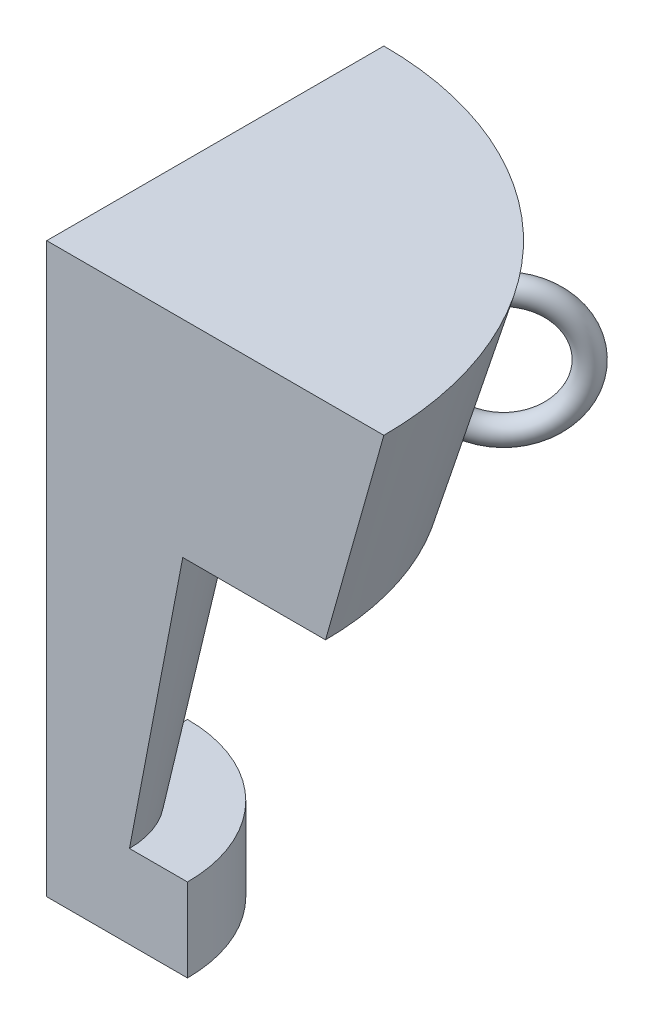
ISO-10303-21;
HEADER;
FILE_DESCRIPTION(('STEP AP214'),'2;1');
FILE_NAME('part.step','',(''),(''),'','','');
FILE_SCHEMA(('AUTOMOTIVE_DESIGN { 1 0 10303 214 1 1 1 1 }'));
ENDSEC;
DATA;
#1=APPLICATION_CONTEXT('core data for automotive mechanical design processes');
#2=APPLICATION_PROTOCOL_DEFINITION('international standard','automotive_design',2000,#1);
#3=PRODUCT_CONTEXT('',#1,'mechanical');
#4=PRODUCT('Part','Part','',(#3));
#5=PRODUCT_RELATED_PRODUCT_CATEGORY('part','',(#4));
#6=PRODUCT_DEFINITION_FORMATION('','',#4);
#7=PRODUCT_DEFINITION_CONTEXT('part definition',#1,'design');
#8=PRODUCT_DEFINITION('design','',#6,#7);
#9=PRODUCT_DEFINITION_SHAPE('','',#8);
#10=(LENGTH_UNIT() NAMED_UNIT(*) SI_UNIT(.MILLI.,.METRE.));
#11=(NAMED_UNIT(*) PLANE_ANGLE_UNIT() SI_UNIT($,.RADIAN.));
#12=(NAMED_UNIT(*) SI_UNIT($,.STERADIAN.) SOLID_ANGLE_UNIT());
#13=UNCERTAINTY_MEASURE_WITH_UNIT(LENGTH_MEASURE(1.E-05),#10,'distance_accuracy_value','');
#14=(GEOMETRIC_REPRESENTATION_CONTEXT(3) GLOBAL_UNCERTAINTY_ASSIGNED_CONTEXT((#13)) GLOBAL_UNIT_ASSIGNED_CONTEXT((#10,
#11,#12)) REPRESENTATION_CONTEXT('',''));
#15=CARTESIAN_POINT('',(0.,0.,0.));
#16=DIRECTION('',(0.,0.,1.));
#17=DIRECTION('',(1.,0.,0.));
#18=AXIS2_PLACEMENT_3D('',#15,#16,#17);
#19=CARTESIAN_POINT('',(0.,58.2177475068306,0.));
#20=DIRECTION('',(0.,1.,0.));
#21=DIRECTION('',(0.,0.,1.));
#22=AXIS2_PLACEMENT_3D('',#19,#20,#21);
#23=CONICAL_SURFACE('',#22,44.8585287538697,0.275531499985695);
#24=CARTESIAN_POINT('',(35.5940219265061,84.7891645665427,-38.4157945053826));
#25=CARTESIAN_POINT('',(35.6223648787228,84.902069427442,-38.4330502836493));
#26=CARTESIAN_POINT('',(35.6577733919979,85.0143245064468,-38.4435087468025));
#27=CARTESIAN_POINT('',(35.7417914538497,85.2343399213014,-38.4503777887173));
#28=CARTESIAN_POINT('',(35.7904158705934,85.3420950361244,-38.4467724840791));
#29=CARTESIAN_POINT('',(35.8995417309926,85.5499808432688,-38.425369114325));
#30=CARTESIAN_POINT('',(35.9600472144908,85.6501089261021,-38.4075662153717));
#31=CARTESIAN_POINT('',(36.0911823558137,85.8396841115878,-38.3579911307056));
#32=CARTESIAN_POINT('',(36.1618089725081,85.9291344078843,-38.3262231352246));
#33=CARTESIAN_POINT('',(36.3098799082835,86.0932575198573,-38.2499725804186));
#34=CARTESIAN_POINT('',(36.3871946571666,86.1681470219277,-38.2057052216436));
#35=CARTESIAN_POINT('',(36.5472756407923,86.3025581941336,-38.1052728448716));
#36=CARTESIAN_POINT('',(36.6300412549255,86.3620816099946,-38.0491091797228));
#37=CARTESIAN_POINT('',(36.7961585587554,86.4624142472336,-37.9280098034336));
#38=CARTESIAN_POINT('',(36.8794337996563,86.5036862431923,-37.8633525543629));
#39=CARTESIAN_POINT('',(37.0461746442387,86.5684746407337,-37.7259019465926));
#40=CARTESIAN_POINT('',(37.1296402184315,86.5919936272094,-37.6531097741357));
#41=CARTESIAN_POINT('',(37.2924073926879,86.6201833847608,-37.5031417191258));
#42=CARTESIAN_POINT('',(37.3717601294543,86.6252548371856,-37.4260964056653));
#43=CARTESIAN_POINT('',(37.5259022909493,86.6175022792061,-37.2684310675248));
#44=CARTESIAN_POINT('',(37.6006920169358,86.6046794515502,-37.1878112794458));
#45=CARTESIAN_POINT('',(37.7430631632084,86.5617172141566,-37.0259614259006));
#46=CARTESIAN_POINT('',(37.8106943349234,86.5317081011255,-36.9447404413342));
#47=CARTESIAN_POINT('',(37.9376004632804,86.4554129167902,-36.7834315833818));
#48=CARTESIAN_POINT('',(37.9968751817386,86.4091263816625,-36.7033437423525));
#49=CARTESIAN_POINT('',(38.106135736096,86.3011595453887,-36.5458116234191));
#50=CARTESIAN_POINT('',(38.1560264910082,86.2393351111063,-36.4684002831482));
#51=CARTESIAN_POINT('',(38.2446737574201,86.1023566650958,-36.3192092303872));
#52=CARTESIAN_POINT('',(38.2834291665744,86.0272013348637,-36.2474300759672));
#53=CARTESIAN_POINT('',(38.3497696721557,85.8638687104769,-36.1099103639366));
#54=CARTESIAN_POINT('',(38.377083827896,85.7754364779368,-36.0443420048586));
#55=CARTESIAN_POINT('',(38.418797711721,85.5893580080576,-35.9228934751294));
#56=CARTESIAN_POINT('',(38.4331957231946,85.4917105478805,-35.8670145930472));
#57=CARTESIAN_POINT('',(38.4491433327694,85.2871661227164,-35.7650666734813));
#58=CARTESIAN_POINT('',(38.4503422860982,85.1800926035725,-35.7192968855033));
#59=CARTESIAN_POINT('',(38.4391412330824,84.961974917474,-35.6407141874113));
#60=CARTESIAN_POINT('',(38.4267395634034,84.8509302664633,-35.6079028627644));
#61=CARTESIAN_POINT('',(38.388381322991,84.6255799936652,-35.5555596472536));
#62=CARTESIAN_POINT('',(38.3621520511461,84.5112541921998,-35.5363138157129));
#63=CARTESIAN_POINT('',(38.2967153265248,84.2847933676811,-35.5127288093888));
#64=CARTESIAN_POINT('',(38.2575069926458,84.1726584939096,-35.508390646862));
#65=CARTESIAN_POINT('',(38.1668229826968,83.9530804436884,-35.5147777123637));
#66=CARTESIAN_POINT('',(38.1152721810843,83.845670963491,-35.5255972383666));
#67=CARTESIAN_POINT('',(38.0013211597696,83.6394945711289,-35.5622077773303));
#68=CARTESIAN_POINT('',(37.9389212770596,83.540727390662,-35.5879983253222));
#69=CARTESIAN_POINT('',(37.8056768026994,83.3560709781234,-35.6534626714092));
#70=CARTESIAN_POINT('',(37.7349452159655,83.2700386097508,-35.6929622481263));
#71=CARTESIAN_POINT('',(37.5862706613776,83.1122412789484,-35.784819979076));
#72=CARTESIAN_POINT('',(37.5083288096778,83.0404741136527,-35.8371761451682));
#73=CARTESIAN_POINT('',(37.3496586313334,82.915513470272,-35.9515800348399));
#74=CARTESIAN_POINT('',(37.2690710119985,82.8618529906642,-36.0133125633668));
#75=CARTESIAN_POINT('',(37.1053715985544,82.7722962303663,-36.145675969043));
#76=CARTESIAN_POINT('',(37.0222603447801,82.736396175065,-36.2163049514282));
#77=CARTESIAN_POINT('',(36.8586468288307,82.6845494765044,-36.3619276240276));
#78=CARTESIAN_POINT('',(36.778146229086,82.6680007976721,-36.4367091745368));
#79=CARTESIAN_POINT('',(36.6194301682388,82.6534113748763,-36.5903820937625));
#80=CARTESIAN_POINT('',(36.5412144141309,82.6553682472419,-36.6692729318664));
#81=CARTESIAN_POINT('',(36.3907499382952,82.6775094644823,-36.8273944875767));
#82=CARTESIAN_POINT('',(36.3184191049156,82.6973648079718,-36.9065934792845));
#83=CARTESIAN_POINT('',(36.1802299530249,82.7541428993834,-37.0645088658389));
#84=CARTESIAN_POINT('',(36.1143717221061,82.7910658782396,-37.143225254141));
#85=CARTESIAN_POINT('',(35.9905225895748,82.8810297004857,-37.2985986388296));
#86=CARTESIAN_POINT('',(35.9325871012784,82.934176422143,-37.3752383941265));
#87=CARTESIAN_POINT('',(35.8266379233289,83.0547785930898,-37.5239667286859));
#88=CARTESIAN_POINT('',(35.7786249958493,83.1222351407421,-37.5960549580406));
#89=CARTESIAN_POINT('',(35.6925993846305,83.2713707342344,-37.7357976454529));
#90=CARTESIAN_POINT('',(35.6548850191172,83.3533789608014,-37.803284251261));
#91=CARTESIAN_POINT('',(35.5921098769826,83.5279137049645,-37.9300898356581));
#92=CARTESIAN_POINT('',(35.5670541034047,83.6204443636589,-37.9894055781586));
#93=CARTESIAN_POINT('',(35.5296105944291,83.8165198076264,-38.1002627857951));
#94=CARTESIAN_POINT('',(35.5176560148095,83.9203230482539,-38.1514930139458));
#95=CARTESIAN_POINT('',(35.5081701090379,84.1333486954018,-38.2425486411814));
#96=CARTESIAN_POINT('',(35.5106242987993,84.2425655505071,-38.2823854509969));
#97=CARTESIAN_POINT('',(35.526490074069,84.4251711537533,-38.3380746145571));
#98=CARTESIAN_POINT('',(35.535816999852,84.49788269378,-38.3574566011826));
#99=CARTESIAN_POINT('',(35.560460643071,84.643540755464,-38.3907627875939));
#100=CARTESIAN_POINT('',(35.5757774610894,84.7164872810468,-38.404686895723));
#101=CARTESIAN_POINT('',(35.5940219265061,84.7891645665427,-38.4157945053826));
#102=B_SPLINE_CURVE_WITH_KNOTS('',3,(#24,#25,#26,#27,#28,#29,#30,#31,#32,#33,#34,#35,#36,#37,
#38,#39,#40,#41,#42,#43,#44,#45,#46,#47,#48,#49,#50,#51,#52,#53,#54,#55,#56,#57,#58,#59,#60,#61,
#62,#63,#64,#65,#66,#67,#68,#69,#70,#71,#72,#73,#74,#75,#76,#77,#78,#79,#80,#81,#82,#83,#84,#85,
#86,#87,#88,#89,#90,#91,#92,#93,#94,#95,#96,#97,#98,#99,#100,#101),.UNSPECIFIED.,.T.,.F.,(4,2,2,
2,2,2,2,2,2,2,2,2,2,2,2,2,2,2,2,2,2,2,2,2,2,2,2,2,2,2,2,2,2,2,2,2,2,2,4),(0.,0.352769212094957,
0.70593695151238,1.05922498487448,1.41240708632363,1.75984483660488,2.10724309744979,
2.44524179016257,2.78319125972566,3.1137550857224,3.44429706365569,3.77236562041532,
4.10044352621319,4.43168497679216,4.76295920738553,5.1016868189281,5.44045944215904,
5.78821080460619,6.1360047012334,6.49092937086553,6.84587814001958,7.20304492395916,
7.5602006156327,7.91297422699695,8.26569331984005,8.60845855426159,8.95115090968645,
9.28287151872811,9.6145493999449,9.94025213341894,10.2659592739516,10.5938391890689,
10.9217442799985,11.2583282603081,11.5950451645239,11.9425870488746,12.2897796345291,
12.5168546958416,12.7439335703684),.UNSPECIFIED.);
#103=CARTESIAN_POINT('',(35.5940219265061,84.7891645665427,-38.4157945053826));
#104=VERTEX_POINT('',#103);
#105=EDGE_CURVE('E47',#104,#104,#102,.T.);
#106=ORIENTED_EDGE('',*,*,#105,.F.);
#107=EDGE_LOOP('',(#106));
#108=FACE_BOUND('',#107,.T.);
#109=CARTESIAN_POINT('',(0.,58.2177475068306,0.));
#110=DIRECTION('',(0.,-1.,0.));
#111=DIRECTION('',(0.,0.,-1.));
#112=AXIS2_PLACEMENT_3D('',#109,#110,#111);
#113=CIRCLE('',#112,44.8585287538697);
#114=CARTESIAN_POINT('',(-1.56622716032094E-13,58.2177475068306,-44.8585287538697));
#115=VERTEX_POINT('',#114);
#116=CARTESIAN_POINT('',(44.8585287538697,58.2177475068306,0.));
#117=VERTEX_POINT('',#116);
#118=EDGE_CURVE('E152',#115,#117,#113,.T.);
#119=ORIENTED_EDGE('',*,*,#118,.F.);
#120=DIRECTION('',(0.,0.962280734503106,-0.272058427555851));
#121=VECTOR('',#120,1.);
#122=CARTESIAN_POINT('',(-1.89397490318464E-13,91.42015625,-54.2455971943469));
#123=LINE('',#122,#121);
#124=CARTESIAN_POINT('',(-1.89397490318464E-13,91.42015625,-54.2455971943469));
#125=VERTEX_POINT('',#124);
#126=EDGE_CURVE('E141',#115,#125,#123,.T.);
#127=ORIENTED_EDGE('',*,*,#126,.T.);
#128=CARTESIAN_POINT('',(0.,91.42015625,0.));
#129=DIRECTION('',(0.,-1.,0.));
#130=DIRECTION('',(0.,0.,-1.));
#131=AXIS2_PLACEMENT_3D('',#128,#129,#130);
#132=CIRCLE('',#131,54.2455971943469);
#133=CARTESIAN_POINT('',(54.2455971943469,91.42015625,0.));
#134=VERTEX_POINT('',#133);
#135=EDGE_CURVE('E154',#125,#134,#132,.T.);
#136=ORIENTED_EDGE('',*,*,#135,.T.);
#137=DIRECTION('',(0.272058427555851,0.962280734503106,0.));
#138=VECTOR('',#137,1.);
#139=CARTESIAN_POINT('',(54.2455971943469,91.42015625,0.));
#140=LINE('',#139,#138);
#141=EDGE_CURVE('E126',#117,#134,#140,.T.);
#142=ORIENTED_EDGE('',*,*,#141,.F.);
#143=EDGE_LOOP('',(#119,#127,#136,#142));
#144=FACE_BOUND('',#143,.T.);
#145=CARTESIAN_POINT('',(32.0733198779587,66.8895994107759,-34.7787654142267));
#146=CARTESIAN_POINT('',(32.1191498151386,66.9969290068624,-34.777779124403));
#147=CARTESIAN_POINT('',(32.1712745404923,67.1015911300781,-34.769913420529));
#148=CARTESIAN_POINT('',(32.2866859720039,67.3025947865113,-34.7403917994667));
#149=CARTESIAN_POINT('',(32.3499844407609,67.3989273904468,-34.7187212866176));
#150=CARTESIAN_POINT('',(32.4859820058223,67.5804454810931,-34.6618712999089));
#151=CARTESIAN_POINT('',(32.5586869366918,67.6656239826876,-34.6266834147007));
#152=CARTESIAN_POINT('',(32.7113153994596,67.822098046423,-34.543485080601));
#153=CARTESIAN_POINT('',(32.7912366906881,67.8933978963142,-34.4954786028649));
#154=CARTESIAN_POINT('',(32.9541427856501,68.0184722426934,-34.3888722564158));
#155=CARTESIAN_POINT('',(33.0370286209455,68.0725819440888,-34.3305148195003));
#156=CARTESIAN_POINT('',(33.2048472443675,68.1634380314535,-34.2040341136279));
#157=CARTESIAN_POINT('',(33.2897796990431,68.2001872260941,-34.1359124267071));
#158=CARTESIAN_POINT('',(33.4563502203543,68.2541579516048,-33.9940752061944));
#159=CARTESIAN_POINT('',(33.5380081469971,68.2719550943061,-33.9206017263852));
#160=CARTESIAN_POINT('',(33.6982711443511,68.2894174201668,-33.7683689202532));
#161=CARTESIAN_POINT('',(33.7768766275693,68.28908506194,-33.6896103121146));
#162=CARTESIAN_POINT('',(33.9273129882012,68.2704796009448,-33.5306186644527));
#163=CARTESIAN_POINT('',(33.9992418975362,68.2525366826946,-33.4504394097981));
#164=CARTESIAN_POINT('',(34.1359660321862,68.1998027830831,-33.2895511046003));
#165=CARTESIAN_POINT('',(34.2007612360071,68.1650117509597,-33.2088420524617));
#166=CARTESIAN_POINT('',(34.3219036806465,68.0794742854006,-33.0487703153124));
#167=CARTESIAN_POINT('',(34.3782033750053,68.0286426425352,-32.9694172633826));
#168=CARTESIAN_POINT('',(34.4806354735344,67.9126567524515,-32.8147272619594));
#169=CARTESIAN_POINT('',(34.5267667524558,67.8475009216937,-32.7393907576404));
#170=CARTESIAN_POINT('',(34.6089430736894,67.7029512334365,-32.5929345134107));
#171=CARTESIAN_POINT('',(34.6447037738833,67.6232391835761,-32.521969442046));
#172=CARTESIAN_POINT('',(34.7038894439864,67.4530303346649,-32.388317608934));
#173=CARTESIAN_POINT('',(34.7273125291541,67.3625318904308,-32.3256321131018));
#174=CARTESIAN_POINT('',(34.7620139610756,67.1702510706037,-32.2083835062632));
#175=CARTESIAN_POINT('',(34.7728918666888,67.068205260521,-32.1541337063544));
#176=CARTESIAN_POINT('',(34.7811062307164,66.8580657666265,-32.0576512277382));
#177=CARTESIAN_POINT('',(34.7784408753966,66.7499712746829,-32.0154201593976));
#178=CARTESIAN_POINT('',(34.7595622835331,66.5281154523958,-31.9432917326756));
#179=CARTESIAN_POINT('',(34.7430395302515,66.4142810019227,-31.9136996726531));
#180=CARTESIAN_POINT('',(34.6965389242218,66.1864941164857,-31.8691239018486));
#181=CARTESIAN_POINT('',(34.6665601796642,66.0725416742013,-31.8541411595229));
#182=CARTESIAN_POINT('',(34.5936672624312,65.8469691917715,-31.839190498344));
#183=CARTESIAN_POINT('',(34.5506671193775,65.7353700941399,-31.8393246390933));
#184=CARTESIAN_POINT('',(34.4528673370342,65.5185876898433,-31.8549154737336));
#185=CARTESIAN_POINT('',(34.3980680555002,65.4134041887783,-31.8703717031027));
#186=CARTESIAN_POINT('',(34.2786871491253,65.2137673688957,-31.9159666820903));
#187=CARTESIAN_POINT('',(34.2142183198861,65.1192098514512,-31.94594402477));
#188=CARTESIAN_POINT('',(34.0766997977566,64.9425179098403,-32.0196864670037));
#189=CARTESIAN_POINT('',(34.003651183341,64.8603819272561,-32.0634498348222));
#190=CARTESIAN_POINT('',(33.8527609137444,64.7130701809937,-32.1622762670956));
#191=CARTESIAN_POINT('',(33.7750765526948,64.6475343920733,-32.2170426322195));
#192=CARTESIAN_POINT('',(33.6154945277521,64.5331216458213,-32.3368748208626));
#193=CARTESIAN_POINT('',(33.5335975721324,64.4842418985394,-32.4019389167963));
#194=CARTESIAN_POINT('',(33.3702126644622,64.4059525876575,-32.5384746267328));
#195=CARTESIAN_POINT('',(33.2887750671154,64.3760459234308,-32.6097216403642));
#196=CARTESIAN_POINT('',(33.1264532691674,64.3346538738497,-32.757961393144));
#197=CARTESIAN_POINT('',(33.045568998761,64.3231661205273,-32.8349533923746));
#198=CARTESIAN_POINT('',(32.8882263062066,64.3190513602616,-32.9909006194835));
#199=CARTESIAN_POINT('',(32.8117132711517,64.3260739020949,-33.0697917452151));
#200=CARTESIAN_POINT('',(32.6637039168807,64.3579957562706,-33.2286481624724));
#201=CARTESIAN_POINT('',(32.5922074309683,64.382894474291,-33.3086134182003));
#202=CARTESIAN_POINT('',(32.4564019147227,64.4496693755741,-33.4672614330857));
#203=CARTESIAN_POINT('',(32.392080045196,64.4915145900661,-33.545946260773));
#204=CARTESIAN_POINT('',(32.2722674570609,64.5908216172409,-33.7001106245336));
#205=CARTESIAN_POINT('',(32.2167772879166,64.6482844009686,-33.7755899609634));
#206=CARTESIAN_POINT('',(32.1153452832131,64.7780444031246,-33.9225910542649));
#207=CARTESIAN_POINT('',(32.0695653487223,64.8505584102597,-33.9940330158685));
#208=CARTESIAN_POINT('',(31.9898785593015,65.0076423189206,-34.1299278747984));
#209=CARTESIAN_POINT('',(31.9559726724011,65.0922132025906,-34.1943802020005));
#210=CARTESIAN_POINT('',(31.9001780303988,65.2732819024186,-34.3163680389886));
#211=CARTESIAN_POINT('',(31.8786213105542,65.3700308231288,-34.3736826212142));
#212=CARTESIAN_POINT('',(31.8494268997909,65.5708973254322,-34.4780866591624));
#213=CARTESIAN_POINT('',(31.8417943628669,65.6750176207101,-34.5251723230031));
#214=CARTESIAN_POINT('',(31.8405934994733,65.8905203159009,-34.6091160120128));
#215=CARTESIAN_POINT('',(31.8473984226617,66.0020214515754,-34.6456741657309));
#216=CARTESIAN_POINT('',(31.8756062644791,66.2265424210513,-34.7059602820273));
#217=CARTESIAN_POINT('',(31.896994305601,66.3395605921081,-34.7297012763182));
#218=CARTESIAN_POINT('',(31.944091378249,66.5259940918217,-34.7580069567592));
#219=CARTESIAN_POINT('',(31.9658886452148,66.5998682088448,-34.7663422655561));
#220=CARTESIAN_POINT('',(32.0153079123807,66.7460856642286,-34.7770485310799));
#221=CARTESIAN_POINT('',(32.0429299743398,66.8184289863497,-34.7794194245642));
#222=CARTESIAN_POINT('',(32.0733198779587,66.8895994107759,-34.7787654142267));
#223=B_SPLINE_CURVE_WITH_KNOTS('',3,(#145,#146,#147,#148,#149,#150,#151,#152,#153,#154,#155,
#156,#157,#158,#159,#160,#161,#162,#163,#164,#165,#166,#167,#168,#169,#170,#171,#172,#173,#174,
#175,#176,#177,#178,#179,#180,#181,#182,#183,#184,#185,#186,#187,#188,#189,#190,#191,#192,#193,
#194,#195,#196,#197,#198,#199,#200,#201,#202,#203,#204,#205,#206,#207,#208,#209,#210,#211,#212,
#213,#214,#215,#216,#217,#218,#219,#220,#221,#222),.UNSPECIFIED.,.T.,.F.,(4,2,2,2,2,2,2,2,2,2,2,
2,2,2,2,2,2,2,2,2,2,2,2,2,2,2,2,2,2,2,2,2,2,2,2,2,2,2,4),(0.,0.349852567766637,
0.700075645811398,1.05051700834717,1.40084993107467,1.7438592214821,2.08681299907727,
2.4190243843639,2.75119071725508,3.07724588723099,3.4033020395914,3.73112025069336,
4.05897472035166,4.39511419746264,4.73130500965397,5.0779534504381,5.42464831613755,
5.77929974413,6.1339746804772,6.4910442994496,6.84810309341881,7.2012810937617,7.55441474722742,
7.89906531648273,8.2436581270469,8.57880263906686,8.91390406085186,9.24270685924598,
9.57149872657165,9.89969243716575,10.2279065583507,10.5612246076503,10.8945698243198,
11.2365014023654,11.5785595197002,11.9295683988917,12.2802197181335,12.5122050477387,
12.7441928371504),.UNSPECIFIED.);
#224=CARTESIAN_POINT('',(32.0733198779587,66.8895994107759,-34.7787654142267));
#225=VERTEX_POINT('',#224);
#226=EDGE_CURVE('E11',#225,#225,#223,.T.);
#227=ORIENTED_EDGE('',*,*,#226,.F.);
#228=EDGE_LOOP('',(#227));
#229=FACE_BOUND('',#228,.T.);
#230=ADVANCED_FACE('F35',(#108,#144,#229),#23,.T.);
#231=CARTESIAN_POINT('',(0.,0.,-22.6477326110135));
#232=DIRECTION('',(0.,-1.,0.));
#233=DIRECTION('',(0.,0.,-1.));
#234=AXIS2_PLACEMENT_3D('',#231,#232,#233);
#235=PLANE('',#234);
#236=DIRECTION('',(1.,0.,0.));
#237=VECTOR('',#236,1.);
#238=CARTESIAN_POINT('',(22.6477326110135,0.,0.));
#239=LINE('',#238,#237);
#240=CARTESIAN_POINT('',(0.,0.,0.));
#241=VERTEX_POINT('',#240);
#242=CARTESIAN_POINT('',(22.6477326110135,0.,0.));
#243=VERTEX_POINT('',#242);
#244=EDGE_CURVE('E54',#241,#243,#239,.T.);
#245=ORIENTED_EDGE('',*,*,#244,.F.);
#246=DIRECTION('',(0.,0.,-1.));
#247=VECTOR('',#246,1.);
#248=CARTESIAN_POINT('',(0.,0.,-22.6477326110135));
#249=LINE('',#248,#247);
#250=CARTESIAN_POINT('',(0.,0.,-22.6477326110135));
#251=VERTEX_POINT('',#250);
#252=EDGE_CURVE('E101',#241,#251,#249,.T.);
#253=ORIENTED_EDGE('',*,*,#252,.T.);
#254=CARTESIAN_POINT('',(0.,0.,0.));
#255=DIRECTION('',(0.,-1.,0.));
#256=DIRECTION('',(0.,0.,-1.));
#257=AXIS2_PLACEMENT_3D('',#254,#255,#256);
#258=CIRCLE('',#257,22.6477326110135);
#259=EDGE_CURVE('E97',#251,#243,#258,.T.);
#260=ORIENTED_EDGE('',*,*,#259,.T.);
#261=EDGE_LOOP('',(#245,#253,#260));
#262=FACE_BOUND('',#261,.T.);
#263=ADVANCED_FACE('F99',(#262),#235,.T.);
#264=CARTESIAN_POINT('',(0.,91.42015625,0.));
#265=DIRECTION('',(0.,1.,0.));
#266=DIRECTION('',(0.,0.,1.));
#267=AXIS2_PLACEMENT_3D('',#264,#265,#266);
#268=PLANE('',#267);
#269=ORIENTED_EDGE('',*,*,#135,.F.);
#270=DIRECTION('',(0.,0.,1.));
#271=VECTOR('',#270,1.);
#272=CARTESIAN_POINT('',(0.,91.42015625,0.));
#273=LINE('',#272,#271);
#274=CARTESIAN_POINT('',(0.,91.42015625,0.));
#275=VERTEX_POINT('',#274);
#276=EDGE_CURVE('E144',#125,#275,#273,.T.);
#277=ORIENTED_EDGE('',*,*,#276,.T.);
#278=DIRECTION('',(-1.,0.,0.));
#279=VECTOR('',#278,1.);
#280=CARTESIAN_POINT('',(0.,91.42015625,0.));
#281=LINE('',#280,#279);
#282=EDGE_CURVE('E61',#134,#275,#281,.T.);
#283=ORIENTED_EDGE('',*,*,#282,.F.);
#284=EDGE_LOOP('',(#269,#277,#283));
#285=FACE_BOUND('',#284,.T.);
#286=ADVANCED_FACE('F164',(#285),#268,.T.);
#287=CARTESIAN_POINT('',(-1.56622716032094E-13,58.2177475068306,-44.8585287538697));
#288=DIRECTION('',(0.,-1.,0.));
#289=DIRECTION('',(0.,0.,-1.));
#290=AXIS2_PLACEMENT_3D('',#287,#288,#289);
#291=PLANE('',#290);
#292=CARTESIAN_POINT('',(0.,58.2177475068306,0.));
#293=DIRECTION('',(0.,-1.,0.));
#294=DIRECTION('',(0.,0.,-1.));
#295=AXIS2_PLACEMENT_3D('',#292,#293,#294);
#296=CIRCLE('',#295,21.8881864493028);
#297=CARTESIAN_POINT('',(0.,58.2177475068306,-21.8881864493028));
#298=VERTEX_POINT('',#297);
#299=CARTESIAN_POINT('',(21.8881864493028,58.2177475068306,0.));
#300=VERTEX_POINT('',#299);
#301=EDGE_CURVE('E150',#298,#300,#296,.T.);
#302=ORIENTED_EDGE('',*,*,#301,.F.);
#303=DIRECTION('',(0.,0.,-1.));
#304=VECTOR('',#303,1.);
#305=CARTESIAN_POINT('',(-1.56622716032094E-13,58.2177475068306,-44.8585287538697));
#306=LINE('',#305,#304);
#307=EDGE_CURVE('E138',#298,#115,#306,.T.);
#308=ORIENTED_EDGE('',*,*,#307,.T.);
#309=ORIENTED_EDGE('',*,*,#118,.T.);
#310=DIRECTION('',(1.,0.,0.));
#311=VECTOR('',#310,1.);
#312=CARTESIAN_POINT('',(44.8585287538697,58.2177475068306,0.));
#313=LINE('',#312,#311);
#314=EDGE_CURVE('E123',#300,#117,#313,.T.);
#315=ORIENTED_EDGE('',*,*,#314,.F.);
#316=EDGE_LOOP('',(#302,#308,#309,#315));
#317=FACE_BOUND('',#316,.T.);
#318=ADVANCED_FACE('F162',(#317),#291,.T.);
#319=CARTESIAN_POINT('',(0.,13.3813020833333,0.));
#320=DIRECTION('',(0.,1.,0.));
#321=DIRECTION('',(0.,0.,1.));
#322=AXIS2_PLACEMENT_3D('',#319,#320,#321);
#323=CONICAL_SURFACE('',#322,13.3145555276802,0.188939300508649);
#324=CARTESIAN_POINT('',(0.,13.3813020833333,0.));
#325=DIRECTION('',(0.,-1.,0.));
#326=DIRECTION('',(0.,0.,-1.));
#327=AXIS2_PLACEMENT_3D('',#324,#325,#326);
#328=CIRCLE('',#327,13.3145555276802);
#329=CARTESIAN_POINT('',(0.,13.3813020833333,-13.3145555276802));
#330=VERTEX_POINT('',#329);
#331=CARTESIAN_POINT('',(13.3145555276802,13.3813020833333,0.));
#332=VERTEX_POINT('',#331);
#333=EDGE_CURVE('E148',#330,#332,#328,.T.);
#334=ORIENTED_EDGE('',*,*,#333,.F.);
#335=DIRECTION('',(0.,0.98220400519526,-0.187817177538129));
#336=VECTOR('',#335,1.);
#337=CARTESIAN_POINT('',(0.,58.2177475068306,-21.8881864493028));
#338=LINE('',#337,#336);
#339=EDGE_CURVE('E135',#330,#298,#338,.T.);
#340=ORIENTED_EDGE('',*,*,#339,.T.);
#341=ORIENTED_EDGE('',*,*,#301,.T.);
#342=DIRECTION('',(0.187817177538129,0.98220400519526,0.));
#343=VECTOR('',#342,1.);
#344=CARTESIAN_POINT('',(21.8881864493028,58.2177475068306,0.));
#345=LINE('',#344,#343);
#346=EDGE_CURVE('E120',#332,#300,#345,.T.);
#347=ORIENTED_EDGE('',*,*,#346,.F.);
#348=EDGE_LOOP('',(#334,#340,#341,#347));
#349=FACE_BOUND('',#348,.T.);
#350=ADVANCED_FACE('F172',(#349),#323,.T.);
#351=CARTESIAN_POINT('',(0.,13.3813020833333,-13.3145555276802));
#352=DIRECTION('',(0.,1.,0.));
#353=DIRECTION('',(0.,0.,1.));
#354=AXIS2_PLACEMENT_3D('',#351,#352,#353);
#355=PLANE('',#354);
#356=CARTESIAN_POINT('',(0.,13.3813020833333,0.));
#357=DIRECTION('',(0.,-1.,0.));
#358=DIRECTION('',(0.,0.,-1.));
#359=AXIS2_PLACEMENT_3D('',#356,#357,#358);
#360=CIRCLE('',#359,22.6477326110135);
#361=CARTESIAN_POINT('',(0.,13.3813020833333,-22.6477326110135));
#362=VERTEX_POINT('',#361);
#363=CARTESIAN_POINT('',(22.6477326110135,13.3813020833333,0.));
#364=VERTEX_POINT('',#363);
#365=EDGE_CURVE('E105',#362,#364,#360,.T.);
#366=ORIENTED_EDGE('',*,*,#365,.F.);
#367=DIRECTION('',(0.,0.,1.));
#368=VECTOR('',#367,1.);
#369=CARTESIAN_POINT('',(0.,13.3813020833333,-13.3145555276802));
#370=LINE('',#369,#368);
#371=EDGE_CURVE('E132',#362,#330,#370,.T.);
#372=ORIENTED_EDGE('',*,*,#371,.T.);
#373=ORIENTED_EDGE('',*,*,#333,.T.);
#374=DIRECTION('',(-1.,0.,0.));
#375=VECTOR('',#374,1.);
#376=CARTESIAN_POINT('',(13.3145555276802,13.3813020833333,0.));
#377=LINE('',#376,#375);
#378=EDGE_CURVE('E113',#364,#332,#377,.T.);
#379=ORIENTED_EDGE('',*,*,#378,.F.);
#380=EDGE_LOOP('',(#366,#372,#373,#379));
#381=FACE_BOUND('',#380,.T.);
#382=ADVANCED_FACE('F186',(#381),#355,.T.);
#383=CARTESIAN_POINT('',(0.,0.,0.));
#384=DIRECTION('',(0.,-1.,0.));
#385=DIRECTION('',(0.,0.,-1.));
#386=AXIS2_PLACEMENT_3D('',#383,#384,#385);
#387=CYLINDRICAL_SURFACE('',#386,22.6477326110135);
#388=DIRECTION('',(0.,1.,0.));
#389=VECTOR('',#388,1.);
#390=CARTESIAN_POINT('',(0.,13.3813020833333,-22.6477326110135));
#391=LINE('',#390,#389);
#392=EDGE_CURVE('E130',#251,#362,#391,.T.);
#393=ORIENTED_EDGE('',*,*,#392,.T.);
#394=ORIENTED_EDGE('',*,*,#365,.T.);
#395=DIRECTION('',(0.,1.,0.));
#396=VECTOR('',#395,1.);
#397=CARTESIAN_POINT('',(22.6477326110135,13.3813020833333,0.));
#398=LINE('',#397,#396);
#399=EDGE_CURVE('E109',#243,#364,#398,.T.);
#400=ORIENTED_EDGE('',*,*,#399,.F.);
#401=ORIENTED_EDGE('',*,*,#259,.F.);
#402=EDGE_LOOP('',(#393,#394,#400,#401));
#403=FACE_BOUND('',#402,.T.);
#404=ADVANCED_FACE('F110',(#403),#387,.T.);
#405=CARTESIAN_POINT('',(0.,0.,0.));
#406=DIRECTION('',(-1.,0.,0.));
#407=DIRECTION('',(0.,0.,1.));
#408=AXIS2_PLACEMENT_3D('',#405,#406,#407);
#409=PLANE('',#408);
#410=ORIENTED_EDGE('',*,*,#252,.F.);
#411=DIRECTION('',(0.,-1.,0.));
#412=VECTOR('',#411,1.);
#413=CARTESIAN_POINT('',(0.,0.,0.));
#414=LINE('',#413,#412);
#415=EDGE_CURVE('E106',#275,#241,#414,.T.);
#416=ORIENTED_EDGE('',*,*,#415,.F.);
#417=ORIENTED_EDGE('',*,*,#276,.F.);
#418=ORIENTED_EDGE('',*,*,#126,.F.);
#419=ORIENTED_EDGE('',*,*,#307,.F.);
#420=ORIENTED_EDGE('',*,*,#339,.F.);
#421=ORIENTED_EDGE('',*,*,#371,.F.);
#422=ORIENTED_EDGE('',*,*,#392,.F.);
#423=EDGE_LOOP('',(#410,#416,#417,#418,#419,#420,#421,#422));
#424=FACE_BOUND('',#423,.T.);
#425=ADVANCED_FACE('F182',(#424),#409,.T.);
#426=CARTESIAN_POINT('',(0.,0.,0.));
#427=DIRECTION('',(0.,0.,-1.));
#428=DIRECTION('',(-1.,0.,0.));
#429=AXIS2_PLACEMENT_3D('',#426,#427,#428);
#430=PLANE('',#429);
#431=ORIENTED_EDGE('',*,*,#244,.T.);
#432=ORIENTED_EDGE('',*,*,#399,.T.);
#433=ORIENTED_EDGE('',*,*,#378,.T.);
#434=ORIENTED_EDGE('',*,*,#346,.T.);
#435=ORIENTED_EDGE('',*,*,#314,.T.);
#436=ORIENTED_EDGE('',*,*,#141,.T.);
#437=ORIENTED_EDGE('',*,*,#282,.T.);
#438=ORIENTED_EDGE('',*,*,#415,.T.);
#439=EDGE_LOOP('',(#431,#432,#433,#434,#435,#436,#437,#438));
#440=FACE_BOUND('',#439,.T.);
#441=ADVANCED_FACE('F115',(#440),#430,.F.);
#442=CARTESIAN_POINT('',(36.744591110686,74.8417609950237,-36.7445911106861));
#443=DIRECTION('',(0.707106781186549,0.,0.707106781186546));
#444=DIRECTION('',(0.707106781186546,0.,-0.707106781186549));
#445=AXIS2_PLACEMENT_3D('',#442,#443,#444);
#446=TOROIDAL_SURFACE('',#445,9.8171013661691,2.);
#447=ORIENTED_EDGE('',*,*,#226,.T.);
#448=EDGE_LOOP('',(#447));
#449=FACE_BOUND('',#448,.T.);
#450=ORIENTED_EDGE('',*,*,#105,.T.);
#451=EDGE_LOOP('',(#450));
#452=FACE_BOUND('',#451,.T.);
#453=ADVANCED_FACE('F37',(#449,#452),#446,.T.);
#454=CLOSED_SHELL('',(#230,#263,#286,#318,#350,#382,#404,#425,#441,#453));
#455=MANIFOLD_SOLID_BREP('B2',#454);
#456=ADVANCED_BREP_SHAPE_REPRESENTATION('',(#18,#455),#14);
#457=SHAPE_DEFINITION_REPRESENTATION(#9,#456);
ENDSEC;
END-ISO-10303-21;
